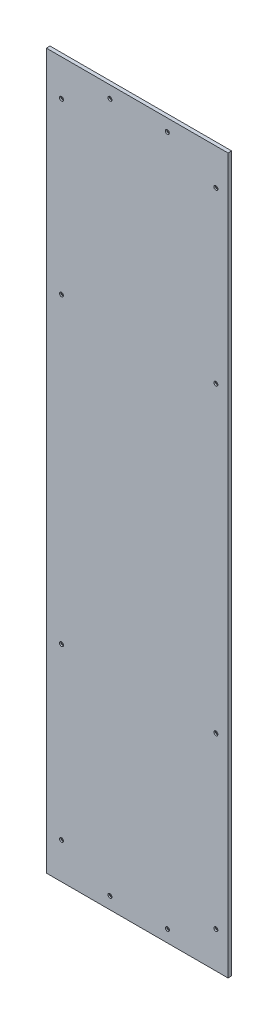
ISO-10303-21;
HEADER;
FILE_DESCRIPTION(('STEP AP214'),'2;1');
FILE_NAME('part.step','',(''),(''),'','','');
FILE_SCHEMA(('AUTOMOTIVE_DESIGN { 1 0 10303 214 1 1 1 1 }'));
ENDSEC;
DATA;
#1=APPLICATION_CONTEXT('core data for automotive mechanical design processes');
#2=APPLICATION_PROTOCOL_DEFINITION('international standard','automotive_design',2000,#1);
#3=PRODUCT_CONTEXT('',#1,'mechanical');
#4=PRODUCT('Part','Part','',(#3));
#5=PRODUCT_RELATED_PRODUCT_CATEGORY('part','',(#4));
#6=PRODUCT_DEFINITION_FORMATION('','',#4);
#7=PRODUCT_DEFINITION_CONTEXT('part definition',#1,'design');
#8=PRODUCT_DEFINITION('design','',#6,#7);
#9=PRODUCT_DEFINITION_SHAPE('','',#8);
#10=(LENGTH_UNIT() NAMED_UNIT(*) SI_UNIT(.MILLI.,.METRE.));
#11=(NAMED_UNIT(*) PLANE_ANGLE_UNIT() SI_UNIT($,.RADIAN.));
#12=(NAMED_UNIT(*) SI_UNIT($,.STERADIAN.) SOLID_ANGLE_UNIT());
#13=UNCERTAINTY_MEASURE_WITH_UNIT(LENGTH_MEASURE(1.E-05),#10,'distance_accuracy_value','');
#14=(GEOMETRIC_REPRESENTATION_CONTEXT(3) GLOBAL_UNCERTAINTY_ASSIGNED_CONTEXT((#13)) GLOBAL_UNIT_ASSIGNED_CONTEXT((#10,
#11,#12)) REPRESENTATION_CONTEXT('',''));
#15=CARTESIAN_POINT('',(0.,0.,0.));
#16=DIRECTION('',(0.,0.,1.));
#17=DIRECTION('',(1.,0.,0.));
#18=AXIS2_PLACEMENT_3D('',#15,#16,#17);
#19=CARTESIAN_POINT('',(0.,0.,-3.));
#20=DIRECTION('',(0.,0.,1.));
#21=DIRECTION('',(1.,0.,0.));
#22=AXIS2_PLACEMENT_3D('',#19,#20,#21);
#23=PLANE('',#22);
#24=CARTESIAN_POINT('',(280.,1120.,-2.9999999999859));
#25=DIRECTION('',(0.,0.,-1.));
#26=DIRECTION('',(0.,1.,0.));
#27=AXIS2_PLACEMENT_3D('',#24,#25,#26);
#28=CIRCLE('',#27,6.85500000005734);
#29=CARTESIAN_POINT('',(280.,1126.85500000006,-2.9999999999859));
#30=VERTEX_POINT('',#29);
#31=EDGE_CURVE('E69',#30,#30,#28,.F.);
#32=ORIENTED_EDGE('',*,*,#31,.T.);
#33=EDGE_LOOP('',(#32));
#34=FACE_BOUND('',#33,.T.);
#35=CARTESIAN_POINT('',(280.,60.,-2.9999999999859));
#36=DIRECTION('',(0.,0.,-1.));
#37=DIRECTION('',(0.,1.,0.));
#38=AXIS2_PLACEMENT_3D('',#35,#36,#37);
#39=CIRCLE('',#38,6.85500000005734);
#40=CARTESIAN_POINT('',(280.,66.8550000000573,-2.9999999999859));
#41=VERTEX_POINT('',#40);
#42=EDGE_CURVE('E117',#41,#41,#39,.F.);
#43=ORIENTED_EDGE('',*,*,#42,.T.);
#44=EDGE_LOOP('',(#43));
#45=FACE_BOUND('',#44,.T.);
#46=CARTESIAN_POINT('',(280.,840.,-2.9999999999859));
#47=DIRECTION('',(0.,0.,-1.));
#48=DIRECTION('',(0.,1.,0.));
#49=AXIS2_PLACEMENT_3D('',#46,#47,#48);
#50=CIRCLE('',#49,6.85500000005734);
#51=CARTESIAN_POINT('',(280.,846.855000000057,-2.9999999999859));
#52=VERTEX_POINT('',#51);
#53=EDGE_CURVE('E120',#52,#52,#50,.F.);
#54=ORIENTED_EDGE('',*,*,#53,.T.);
#55=EDGE_LOOP('',(#54));
#56=FACE_BOUND('',#55,.T.);
#57=CARTESIAN_POINT('',(280.,340.,-2.9999999999859));
#58=DIRECTION('',(0.,0.,-1.));
#59=DIRECTION('',(0.,1.,0.));
#60=AXIS2_PLACEMENT_3D('',#57,#58,#59);
#61=CIRCLE('',#60,6.85500000005734);
#62=CARTESIAN_POINT('',(280.,346.855000000057,-2.9999999999859));
#63=VERTEX_POINT('',#62);
#64=EDGE_CURVE('E123',#63,#63,#61,.F.);
#65=ORIENTED_EDGE('',*,*,#64,.T.);
#66=EDGE_LOOP('',(#65));
#67=FACE_BOUND('',#66,.T.);
#68=CARTESIAN_POINT('',(105.,1160.,-2.9999999999859));
#69=DIRECTION('',(0.,0.,-1.));
#70=DIRECTION('',(-1.,0.,0.));
#71=AXIS2_PLACEMENT_3D('',#68,#69,#70);
#72=CIRCLE('',#71,6.85499999995499);
#73=CARTESIAN_POINT('',(98.145000000045,1160.,-2.9999999999859));
#74=VERTEX_POINT('',#73);
#75=EDGE_CURVE('E126',#74,#74,#72,.F.);
#76=ORIENTED_EDGE('',*,*,#75,.T.);
#77=EDGE_LOOP('',(#76));
#78=FACE_BOUND('',#77,.T.);
#79=CARTESIAN_POINT('',(199.7,1160.,-2.99999999992906));
#80=DIRECTION('',(0.,0.,-1.));
#81=DIRECTION('',(0.,1.,0.));
#82=AXIS2_PLACEMENT_3D('',#79,#80,#81);
#83=CIRCLE('',#82,6.85499999996608);
#84=CARTESIAN_POINT('',(199.7,1166.85499999997,-2.99999999992906));
#85=VERTEX_POINT('',#84);
#86=EDGE_CURVE('E129',#85,#85,#83,.F.);
#87=ORIENTED_EDGE('',*,*,#86,.T.);
#88=EDGE_LOOP('',(#87));
#89=FACE_BOUND('',#88,.T.);
#90=CARTESIAN_POINT('',(25.,1120.,-2.9999999999859));
#91=DIRECTION('',(0.,0.,-1.));
#92=DIRECTION('',(-1.,0.,0.));
#93=AXIS2_PLACEMENT_3D('',#90,#91,#92);
#94=CIRCLE('',#93,6.85499999993908);
#95=CARTESIAN_POINT('',(18.1450000000609,1120.,-2.9999999999859));
#96=VERTEX_POINT('',#95);
#97=EDGE_CURVE('E132',#96,#96,#94,.F.);
#98=ORIENTED_EDGE('',*,*,#97,.T.);
#99=EDGE_LOOP('',(#98));
#100=FACE_BOUND('',#99,.T.);
#101=CARTESIAN_POINT('',(25.,60.,-2.9999999999859));
#102=DIRECTION('',(0.,0.,-1.));
#103=DIRECTION('',(-1.,0.,0.));
#104=AXIS2_PLACEMENT_3D('',#101,#102,#103);
#105=CIRCLE('',#104,6.85499999993908);
#106=CARTESIAN_POINT('',(18.1450000000609,60.,-2.9999999999859));
#107=VERTEX_POINT('',#106);
#108=EDGE_CURVE('E135',#107,#107,#105,.F.);
#109=ORIENTED_EDGE('',*,*,#108,.T.);
#110=EDGE_LOOP('',(#109));
#111=FACE_BOUND('',#110,.T.);
#112=CARTESIAN_POINT('',(25.,840.,-2.9999999999859));
#113=DIRECTION('',(0.,0.,-1.));
#114=DIRECTION('',(-1.,0.,0.));
#115=AXIS2_PLACEMENT_3D('',#112,#113,#114);
#116=CIRCLE('',#115,6.85499999993908);
#117=CARTESIAN_POINT('',(18.1450000000609,840.,-2.9999999999859));
#118=VERTEX_POINT('',#117);
#119=EDGE_CURVE('E138',#118,#118,#116,.F.);
#120=ORIENTED_EDGE('',*,*,#119,.T.);
#121=EDGE_LOOP('',(#120));
#122=FACE_BOUND('',#121,.T.);
#123=CARTESIAN_POINT('',(25.,340.,-2.9999999999859));
#124=DIRECTION('',(0.,0.,-1.));
#125=DIRECTION('',(-1.,0.,0.));
#126=AXIS2_PLACEMENT_3D('',#123,#124,#125);
#127=CIRCLE('',#126,6.85499999993908);
#128=CARTESIAN_POINT('',(18.1450000000609,340.,-2.9999999999859));
#129=VERTEX_POINT('',#128);
#130=EDGE_CURVE('E141',#129,#129,#127,.F.);
#131=ORIENTED_EDGE('',*,*,#130,.T.);
#132=EDGE_LOOP('',(#131));
#133=FACE_BOUND('',#132,.T.);
#134=CARTESIAN_POINT('',(105.,20.,-2.9999999999859));
#135=DIRECTION('',(0.,0.,-1.));
#136=DIRECTION('',(-1.,0.,0.));
#137=AXIS2_PLACEMENT_3D('',#134,#135,#136);
#138=CIRCLE('',#137,6.85499999995499);
#139=CARTESIAN_POINT('',(98.145000000045,20.,-2.9999999999859));
#140=VERTEX_POINT('',#139);
#141=EDGE_CURVE('E143',#140,#140,#138,.F.);
#142=ORIENTED_EDGE('',*,*,#141,.T.);
#143=EDGE_LOOP('',(#142));
#144=FACE_BOUND('',#143,.T.);
#145=CARTESIAN_POINT('',(200.,20.,-3.00000000004275));
#146=DIRECTION('',(0.,0.,-1.));
#147=DIRECTION('',(0.,1.,0.));
#148=AXIS2_PLACEMENT_3D('',#145,#146,#147);
#149=CIRCLE('',#148,6.85500000004141);
#150=CARTESIAN_POINT('',(200.,26.8550000000414,-3.00000000004275));
#151=VERTEX_POINT('',#150);
#152=EDGE_CURVE('E20',#151,#151,#149,.F.);
#153=ORIENTED_EDGE('',*,*,#152,.T.);
#154=EDGE_LOOP('',(#153));
#155=FACE_BOUND('',#154,.T.);
#156=DIRECTION('',(1.,0.,0.));
#157=VECTOR('',#156,1.);
#158=CARTESIAN_POINT('',(300.,1180.,-3.));
#159=LINE('',#158,#157);
#160=CARTESIAN_POINT('',(300.,1180.,-3.));
#161=VERTEX_POINT('',#160);
#162=CARTESIAN_POINT('',(0.,1180.,-3.));
#163=VERTEX_POINT('',#162);
#164=EDGE_CURVE('E160',#161,#163,#159,.F.);
#165=ORIENTED_EDGE('',*,*,#164,.F.);
#166=DIRECTION('',(0.,1.,0.));
#167=VECTOR('',#166,1.);
#168=CARTESIAN_POINT('',(300.,0.,-3.));
#169=LINE('',#168,#167);
#170=CARTESIAN_POINT('',(300.,0.,-3.));
#171=VERTEX_POINT('',#170);
#172=EDGE_CURVE('E71',#171,#161,#169,.T.);
#173=ORIENTED_EDGE('',*,*,#172,.F.);
#174=DIRECTION('',(1.,0.,0.));
#175=VECTOR('',#174,1.);
#176=CARTESIAN_POINT('',(0.,0.,-3.));
#177=LINE('',#176,#175);
#178=CARTESIAN_POINT('',(0.,0.,-3.));
#179=VERTEX_POINT('',#178);
#180=EDGE_CURVE('E55',#179,#171,#177,.T.);
#181=ORIENTED_EDGE('',*,*,#180,.F.);
#182=DIRECTION('',(0.,1.,0.));
#183=VECTOR('',#182,1.);
#184=CARTESIAN_POINT('',(0.,1180.,-3.));
#185=LINE('',#184,#183);
#186=EDGE_CURVE('E60',#163,#179,#185,.F.);
#187=ORIENTED_EDGE('',*,*,#186,.F.);
#188=EDGE_LOOP('',(#165,#173,#181,#187));
#189=FACE_BOUND('',#188,.T.);
#190=ADVANCED_FACE('F17',(#34,#45,#56,#67,#78,#89,#100,#111,#122,#133,#144,#155,#189),#23,.F.);
#191=CARTESIAN_POINT('',(200.,20.,-3.00000000004275));
#192=DIRECTION('',(0.,0.,-1.));
#193=DIRECTION('',(0.,1.,0.));
#194=AXIS2_PLACEMENT_3D('',#191,#192,#193);
#195=CONICAL_SURFACE('',#194,6.85500000004141,0.785397999990634);
#196=ORIENTED_EDGE('',*,*,#152,.F.);
#197=EDGE_LOOP('',(#196));
#198=FACE_BOUND('',#197,.T.);
#199=CARTESIAN_POINT('',(200.,20.,0.555001161756055));
#200=DIRECTION('',(0.,0.,-1.));
#201=DIRECTION('',(-1.,0.,0.));
#202=AXIS2_PLACEMENT_3D('',#199,#200,#201);
#203=CIRCLE('',#202,3.3);
#204=CARTESIAN_POINT('',(196.7,20.,0.555001161756055));
#205=VERTEX_POINT('',#204);
#206=EDGE_CURVE('E157',#205,#205,#203,.F.);
#207=ORIENTED_EDGE('',*,*,#206,.T.);
#208=EDGE_LOOP('',(#207));
#209=FACE_BOUND('',#208,.T.);
#210=ADVANCED_FACE('F151',(#198,#209),#195,.F.);
#211=CARTESIAN_POINT('',(105.,20.,-2.99999999992906));
#212=DIRECTION('',(0.,0.,-1.));
#213=DIRECTION('',(-1.,0.,0.));
#214=AXIS2_PLACEMENT_3D('',#211,#212,#213);
#215=CONICAL_SURFACE('',#214,6.85499999989815,0.785397999990634);
#216=ORIENTED_EDGE('',*,*,#141,.F.);
#217=EDGE_LOOP('',(#216));
#218=FACE_BOUND('',#217,.T.);
#219=CARTESIAN_POINT('',(105.,20.,0.555001161756055));
#220=DIRECTION('',(0.,0.,-1.));
#221=DIRECTION('',(-1.,0.,0.));
#222=AXIS2_PLACEMENT_3D('',#219,#220,#221);
#223=CIRCLE('',#222,3.29999999999998);
#224=CARTESIAN_POINT('',(101.7,20.,0.555001161756055));
#225=VERTEX_POINT('',#224);
#226=EDGE_CURVE('E159',#225,#225,#223,.F.);
#227=ORIENTED_EDGE('',*,*,#226,.T.);
#228=EDGE_LOOP('',(#227));
#229=FACE_BOUND('',#228,.T.);
#230=ADVANCED_FACE('F154',(#218,#229),#215,.F.);
#231=CARTESIAN_POINT('',(25.,340.,-2.99999999992906));
#232=DIRECTION('',(0.,0.,-1.));
#233=DIRECTION('',(-1.,0.,0.));
#234=AXIS2_PLACEMENT_3D('',#231,#232,#233);
#235=CONICAL_SURFACE('',#234,6.85499999988224,0.785397999990634);
#236=ORIENTED_EDGE('',*,*,#130,.F.);
#237=EDGE_LOOP('',(#236));
#238=FACE_BOUND('',#237,.T.);
#239=CARTESIAN_POINT('',(25.,340.,0.555001161756055));
#240=DIRECTION('',(0.,0.,-1.));
#241=DIRECTION('',(-1.,0.,0.));
#242=AXIS2_PLACEMENT_3D('',#239,#240,#241);
#243=CIRCLE('',#242,3.29999999999999);
#244=CARTESIAN_POINT('',(21.7,340.,0.555001161756055));
#245=VERTEX_POINT('',#244);
#246=EDGE_CURVE('E163',#245,#245,#243,.F.);
#247=ORIENTED_EDGE('',*,*,#246,.T.);
#248=EDGE_LOOP('',(#247));
#249=FACE_BOUND('',#248,.T.);
#250=ADVANCED_FACE('F235',(#238,#249),#235,.F.);
#251=CARTESIAN_POINT('',(25.,840.,-2.99999999992906));
#252=DIRECTION('',(0.,0.,-1.));
#253=DIRECTION('',(-1.,0.,0.));
#254=AXIS2_PLACEMENT_3D('',#251,#252,#253);
#255=CONICAL_SURFACE('',#254,6.85499999988224,0.785397999990634);
#256=ORIENTED_EDGE('',*,*,#119,.F.);
#257=EDGE_LOOP('',(#256));
#258=FACE_BOUND('',#257,.T.);
#259=CARTESIAN_POINT('',(25.,840.,0.555001161756055));
#260=DIRECTION('',(0.,0.,-1.));
#261=DIRECTION('',(-1.,0.,0.));
#262=AXIS2_PLACEMENT_3D('',#259,#260,#261);
#263=CIRCLE('',#262,3.29999999999999);
#264=CARTESIAN_POINT('',(21.7,840.,0.555001161756055));
#265=VERTEX_POINT('',#264);
#266=EDGE_CURVE('E223',#265,#265,#263,.F.);
#267=ORIENTED_EDGE('',*,*,#266,.T.);
#268=EDGE_LOOP('',(#267));
#269=FACE_BOUND('',#268,.T.);
#270=ADVANCED_FACE('F305',(#258,#269),#255,.F.);
#271=CARTESIAN_POINT('',(25.,60.,-2.99999999992906));
#272=DIRECTION('',(0.,0.,-1.));
#273=DIRECTION('',(-1.,0.,0.));
#274=AXIS2_PLACEMENT_3D('',#271,#272,#273);
#275=CONICAL_SURFACE('',#274,6.85499999988224,0.785397999990634);
#276=ORIENTED_EDGE('',*,*,#108,.F.);
#277=EDGE_LOOP('',(#276));
#278=FACE_BOUND('',#277,.T.);
#279=CARTESIAN_POINT('',(25.,60.,0.555001161756055));
#280=DIRECTION('',(0.,0.,-1.));
#281=DIRECTION('',(-1.,0.,0.));
#282=AXIS2_PLACEMENT_3D('',#279,#280,#281);
#283=CIRCLE('',#282,3.29999999999999);
#284=CARTESIAN_POINT('',(21.7,60.,0.555001161756055));
#285=VERTEX_POINT('',#284);
#286=EDGE_CURVE('E218',#285,#285,#283,.F.);
#287=ORIENTED_EDGE('',*,*,#286,.T.);
#288=EDGE_LOOP('',(#287));
#289=FACE_BOUND('',#288,.T.);
#290=ADVANCED_FACE('F301',(#278,#289),#275,.F.);
#291=CARTESIAN_POINT('',(25.,1120.,-2.99999999992906));
#292=DIRECTION('',(0.,0.,-1.));
#293=DIRECTION('',(-1.,0.,0.));
#294=AXIS2_PLACEMENT_3D('',#291,#292,#293);
#295=CONICAL_SURFACE('',#294,6.85499999988224,0.785397999990634);
#296=ORIENTED_EDGE('',*,*,#97,.F.);
#297=EDGE_LOOP('',(#296));
#298=FACE_BOUND('',#297,.T.);
#299=CARTESIAN_POINT('',(25.,1120.,0.555001161756055));
#300=DIRECTION('',(0.,0.,-1.));
#301=DIRECTION('',(-1.,0.,0.));
#302=AXIS2_PLACEMENT_3D('',#299,#300,#301);
#303=CIRCLE('',#302,3.29999999999999);
#304=CARTESIAN_POINT('',(21.7,1120.,0.555001161756055));
#305=VERTEX_POINT('',#304);
#306=EDGE_CURVE('E213',#305,#305,#303,.F.);
#307=ORIENTED_EDGE('',*,*,#306,.T.);
#308=EDGE_LOOP('',(#307));
#309=FACE_BOUND('',#308,.T.);
#310=ADVANCED_FACE('F297',(#298,#309),#295,.F.);
#311=CARTESIAN_POINT('',(199.7,1160.,-2.99999999987222));
#312=DIRECTION('',(0.,0.,-1.));
#313=DIRECTION('',(0.,1.,0.));
#314=AXIS2_PLACEMENT_3D('',#311,#312,#313);
#315=CONICAL_SURFACE('',#314,6.85499999990924,0.785397999990634);
#316=ORIENTED_EDGE('',*,*,#86,.F.);
#317=EDGE_LOOP('',(#316));
#318=FACE_BOUND('',#317,.T.);
#319=CARTESIAN_POINT('',(199.7,1160.,0.555001161756055));
#320=DIRECTION('',(0.,0.,-1.));
#321=DIRECTION('',(-1.,0.,0.));
#322=AXIS2_PLACEMENT_3D('',#319,#320,#321);
#323=CIRCLE('',#322,3.3);
#324=CARTESIAN_POINT('',(196.4,1160.,0.555001161756055));
#325=VERTEX_POINT('',#324);
#326=EDGE_CURVE('E208',#325,#325,#323,.F.);
#327=ORIENTED_EDGE('',*,*,#326,.T.);
#328=EDGE_LOOP('',(#327));
#329=FACE_BOUND('',#328,.T.);
#330=ADVANCED_FACE('F293',(#318,#329),#315,.F.);
#331=CARTESIAN_POINT('',(105.,1160.,-2.99999999992906));
#332=DIRECTION('',(0.,0.,-1.));
#333=DIRECTION('',(-1.,0.,0.));
#334=AXIS2_PLACEMENT_3D('',#331,#332,#333);
#335=CONICAL_SURFACE('',#334,6.85499999989815,0.785397999990634);
#336=ORIENTED_EDGE('',*,*,#75,.F.);
#337=EDGE_LOOP('',(#336));
#338=FACE_BOUND('',#337,.T.);
#339=CARTESIAN_POINT('',(105.,1160.,0.555001161756055));
#340=DIRECTION('',(0.,0.,-1.));
#341=DIRECTION('',(-1.,0.,0.));
#342=AXIS2_PLACEMENT_3D('',#339,#340,#341);
#343=CIRCLE('',#342,3.29999999999998);
#344=CARTESIAN_POINT('',(101.7,1160.,0.555001161756055));
#345=VERTEX_POINT('',#344);
#346=EDGE_CURVE('E203',#345,#345,#343,.F.);
#347=ORIENTED_EDGE('',*,*,#346,.T.);
#348=EDGE_LOOP('',(#347));
#349=FACE_BOUND('',#348,.T.);
#350=ADVANCED_FACE('F289',(#338,#349),#335,.F.);
#351=CARTESIAN_POINT('',(280.,340.,-2.99999999987222));
#352=DIRECTION('',(0.,0.,-1.));
#353=DIRECTION('',(0.,1.,0.));
#354=AXIS2_PLACEMENT_3D('',#351,#352,#353);
#355=CONICAL_SURFACE('',#354,6.85499999994366,0.785398000006624);
#356=ORIENTED_EDGE('',*,*,#64,.F.);
#357=EDGE_LOOP('',(#356));
#358=FACE_BOUND('',#357,.T.);
#359=CARTESIAN_POINT('',(280.,340.,0.555001161756055));
#360=DIRECTION('',(0.,0.,-1.));
#361=DIRECTION('',(-1.,0.,0.));
#362=AXIS2_PLACEMENT_3D('',#359,#360,#361);
#363=CIRCLE('',#362,3.29999999999997);
#364=CARTESIAN_POINT('',(276.7,340.,0.555001161756055));
#365=VERTEX_POINT('',#364);
#366=EDGE_CURVE('E198',#365,#365,#363,.F.);
#367=ORIENTED_EDGE('',*,*,#366,.T.);
#368=EDGE_LOOP('',(#367));
#369=FACE_BOUND('',#368,.T.);
#370=ADVANCED_FACE('F285',(#358,#369),#355,.F.);
#371=CARTESIAN_POINT('',(280.,840.,-2.99999999987222));
#372=DIRECTION('',(0.,0.,-1.));
#373=DIRECTION('',(0.,1.,0.));
#374=AXIS2_PLACEMENT_3D('',#371,#372,#373);
#375=CONICAL_SURFACE('',#374,6.85499999994366,0.785398000006624);
#376=ORIENTED_EDGE('',*,*,#53,.F.);
#377=EDGE_LOOP('',(#376));
#378=FACE_BOUND('',#377,.T.);
#379=CARTESIAN_POINT('',(280.,840.,0.555001161756055));
#380=DIRECTION('',(0.,0.,-1.));
#381=DIRECTION('',(-1.,0.,0.));
#382=AXIS2_PLACEMENT_3D('',#379,#380,#381);
#383=CIRCLE('',#382,3.29999999999997);
#384=CARTESIAN_POINT('',(276.7,840.,0.555001161756055));
#385=VERTEX_POINT('',#384);
#386=EDGE_CURVE('E193',#385,#385,#383,.F.);
#387=ORIENTED_EDGE('',*,*,#386,.T.);
#388=EDGE_LOOP('',(#387));
#389=FACE_BOUND('',#388,.T.);
#390=ADVANCED_FACE('F281',(#378,#389),#375,.F.);
#391=CARTESIAN_POINT('',(280.,60.,-2.99999999987222));
#392=DIRECTION('',(0.,0.,-1.));
#393=DIRECTION('',(0.,1.,0.));
#394=AXIS2_PLACEMENT_3D('',#391,#392,#393);
#395=CONICAL_SURFACE('',#394,6.85499999994366,0.785398000006624);
#396=ORIENTED_EDGE('',*,*,#42,.F.);
#397=EDGE_LOOP('',(#396));
#398=FACE_BOUND('',#397,.T.);
#399=CARTESIAN_POINT('',(280.,60.,0.555001161756055));
#400=DIRECTION('',(0.,0.,-1.));
#401=DIRECTION('',(-1.,0.,0.));
#402=AXIS2_PLACEMENT_3D('',#399,#400,#401);
#403=CIRCLE('',#402,3.29999999999997);
#404=CARTESIAN_POINT('',(276.7,60.,0.555001161756055));
#405=VERTEX_POINT('',#404);
#406=EDGE_CURVE('E188',#405,#405,#403,.F.);
#407=ORIENTED_EDGE('',*,*,#406,.T.);
#408=EDGE_LOOP('',(#407));
#409=FACE_BOUND('',#408,.T.);
#410=ADVANCED_FACE('F277',(#398,#409),#395,.F.);
#411=CARTESIAN_POINT('',(280.,1120.,-2.99999999987222));
#412=DIRECTION('',(0.,0.,-1.));
#413=DIRECTION('',(0.,1.,0.));
#414=AXIS2_PLACEMENT_3D('',#411,#412,#413);
#415=CONICAL_SURFACE('',#414,6.85499999994366,0.785398000006624);
#416=ORIENTED_EDGE('',*,*,#31,.F.);
#417=EDGE_LOOP('',(#416));
#418=FACE_BOUND('',#417,.T.);
#419=CARTESIAN_POINT('',(280.,1120.,0.555001161756055));
#420=DIRECTION('',(0.,0.,-1.));
#421=DIRECTION('',(-1.,0.,0.));
#422=AXIS2_PLACEMENT_3D('',#419,#420,#421);
#423=CIRCLE('',#422,3.29999999999997);
#424=CARTESIAN_POINT('',(276.7,1120.,0.555001161756055));
#425=VERTEX_POINT('',#424);
#426=EDGE_CURVE('E182',#425,#425,#423,.F.);
#427=ORIENTED_EDGE('',*,*,#426,.T.);
#428=EDGE_LOOP('',(#427));
#429=FACE_BOUND('',#428,.T.);
#430=ADVANCED_FACE('F274',(#418,#429),#415,.F.);
#431=CARTESIAN_POINT('',(0.,1180.,-3.));
#432=DIRECTION('',(-1.,0.,0.));
#433=DIRECTION('',(0.,0.,1.));
#434=AXIS2_PLACEMENT_3D('',#431,#432,#433);
#435=PLANE('',#434);
#436=DIRECTION('',(0.,0.,1.));
#437=VECTOR('',#436,1.);
#438=CARTESIAN_POINT('',(0.,1180.,-3.));
#439=LINE('',#438,#437);
#440=CARTESIAN_POINT('',(0.,1180.,3.));
#441=VERTEX_POINT('',#440);
#442=EDGE_CURVE('E65',#163,#441,#439,.T.);
#443=ORIENTED_EDGE('',*,*,#442,.F.);
#444=ORIENTED_EDGE('',*,*,#186,.T.);
#445=DIRECTION('',(0.,0.,-1.));
#446=VECTOR('',#445,1.);
#447=CARTESIAN_POINT('',(0.,0.,-3.));
#448=LINE('',#447,#446);
#449=CARTESIAN_POINT('',(0.,0.,3.));
#450=VERTEX_POINT('',#449);
#451=EDGE_CURVE('E62',#450,#179,#448,.T.);
#452=ORIENTED_EDGE('',*,*,#451,.F.);
#453=DIRECTION('',(0.,1.,0.));
#454=VECTOR('',#453,1.);
#455=CARTESIAN_POINT('',(0.,0.,3.));
#456=LINE('',#455,#454);
#457=EDGE_CURVE('E180',#441,#450,#456,.F.);
#458=ORIENTED_EDGE('',*,*,#457,.F.);
#459=EDGE_LOOP('',(#443,#444,#452,#458));
#460=FACE_BOUND('',#459,.T.);
#461=ADVANCED_FACE('F61',(#460),#435,.T.);
#462=CARTESIAN_POINT('',(0.,0.,-3.));
#463=DIRECTION('',(0.,-1.,0.));
#464=DIRECTION('',(0.,0.,-1.));
#465=AXIS2_PLACEMENT_3D('',#462,#463,#464);
#466=PLANE('',#465);
#467=ORIENTED_EDGE('',*,*,#451,.T.);
#468=ORIENTED_EDGE('',*,*,#180,.T.);
#469=DIRECTION('',(0.,0.,-1.));
#470=VECTOR('',#469,1.);
#471=CARTESIAN_POINT('',(300.,0.,-3.));
#472=LINE('',#471,#470);
#473=CARTESIAN_POINT('',(300.,0.,3.));
#474=VERTEX_POINT('',#473);
#475=EDGE_CURVE('E73',#474,#171,#472,.T.);
#476=ORIENTED_EDGE('',*,*,#475,.F.);
#477=DIRECTION('',(1.,0.,0.));
#478=VECTOR('',#477,1.);
#479=CARTESIAN_POINT('',(0.,0.,3.));
#480=LINE('',#479,#478);
#481=EDGE_CURVE('E77',#450,#474,#480,.T.);
#482=ORIENTED_EDGE('',*,*,#481,.F.);
#483=EDGE_LOOP('',(#467,#468,#476,#482));
#484=FACE_BOUND('',#483,.T.);
#485=ADVANCED_FACE('F75',(#484),#466,.T.);
#486=CARTESIAN_POINT('',(300.,0.,-3.));
#487=DIRECTION('',(1.,0.,0.));
#488=DIRECTION('',(0.,0.,-1.));
#489=AXIS2_PLACEMENT_3D('',#486,#487,#488);
#490=PLANE('',#489);
#491=ORIENTED_EDGE('',*,*,#475,.T.);
#492=ORIENTED_EDGE('',*,*,#172,.T.);
#493=DIRECTION('',(0.,0.,1.));
#494=VECTOR('',#493,1.);
#495=CARTESIAN_POINT('',(300.,1180.,-3.));
#496=LINE('',#495,#494);
#497=CARTESIAN_POINT('',(300.,1180.,3.));
#498=VERTEX_POINT('',#497);
#499=EDGE_CURVE('E35',#498,#161,#496,.F.);
#500=ORIENTED_EDGE('',*,*,#499,.F.);
#501=DIRECTION('',(0.,1.,0.));
#502=VECTOR('',#501,1.);
#503=CARTESIAN_POINT('',(300.,0.,3.));
#504=LINE('',#503,#502);
#505=EDGE_CURVE('E175',#474,#498,#504,.T.);
#506=ORIENTED_EDGE('',*,*,#505,.F.);
#507=EDGE_LOOP('',(#491,#492,#500,#506));
#508=FACE_BOUND('',#507,.T.);
#509=ADVANCED_FACE('F173',(#508),#490,.T.);
#510=CARTESIAN_POINT('',(300.,1180.,-3.));
#511=DIRECTION('',(0.,1.,0.));
#512=DIRECTION('',(0.,0.,1.));
#513=AXIS2_PLACEMENT_3D('',#510,#511,#512);
#514=PLANE('',#513);
#515=ORIENTED_EDGE('',*,*,#499,.T.);
#516=ORIENTED_EDGE('',*,*,#164,.T.);
#517=ORIENTED_EDGE('',*,*,#442,.T.);
#518=DIRECTION('',(1.,0.,0.));
#519=VECTOR('',#518,1.);
#520=CARTESIAN_POINT('',(0.,1180.,3.));
#521=LINE('',#520,#519);
#522=EDGE_CURVE('E114',#498,#441,#521,.F.);
#523=ORIENTED_EDGE('',*,*,#522,.F.);
#524=EDGE_LOOP('',(#515,#516,#517,#523));
#525=FACE_BOUND('',#524,.T.);
#526=ADVANCED_FACE('F256',(#525),#514,.T.);
#527=CARTESIAN_POINT('',(200.,20.,-3.));
#528=DIRECTION('',(0.,0.,-1.));
#529=DIRECTION('',(-1.,0.,0.));
#530=AXIS2_PLACEMENT_3D('',#527,#528,#529);
#531=CYLINDRICAL_SURFACE('',#530,3.3);
#532=ORIENTED_EDGE('',*,*,#206,.F.);
#533=EDGE_LOOP('',(#532));
#534=FACE_BOUND('',#533,.T.);
#535=CARTESIAN_POINT('',(200.,20.,3.00000000000001));
#536=DIRECTION('',(0.,0.,-1.));
#537=DIRECTION('',(-1.,0.,0.));
#538=AXIS2_PLACEMENT_3D('',#535,#536,#537);
#539=CIRCLE('',#538,3.3);
#540=CARTESIAN_POINT('',(196.7,20.,3.00000000000001));
#541=VERTEX_POINT('',#540);
#542=EDGE_CURVE('E111',#541,#541,#539,.T.);
#543=ORIENTED_EDGE('',*,*,#542,.F.);
#544=EDGE_LOOP('',(#543));
#545=FACE_BOUND('',#544,.T.);
#546=ADVANCED_FACE('F254',(#534,#545),#531,.F.);
#547=CARTESIAN_POINT('',(105.,20.,-3.));
#548=DIRECTION('',(0.,0.,-1.));
#549=DIRECTION('',(-1.,0.,0.));
#550=AXIS2_PLACEMENT_3D('',#547,#548,#549);
#551=CYLINDRICAL_SURFACE('',#550,3.29999999999998);
#552=ORIENTED_EDGE('',*,*,#226,.F.);
#553=EDGE_LOOP('',(#552));
#554=FACE_BOUND('',#553,.T.);
#555=CARTESIAN_POINT('',(105.,20.,3.00000000000001));
#556=DIRECTION('',(0.,0.,-1.));
#557=DIRECTION('',(-1.,0.,0.));
#558=AXIS2_PLACEMENT_3D('',#555,#556,#557);
#559=CIRCLE('',#558,3.29999999999998);
#560=CARTESIAN_POINT('',(101.7,20.,3.00000000000001));
#561=VERTEX_POINT('',#560);
#562=EDGE_CURVE('E108',#561,#561,#559,.T.);
#563=ORIENTED_EDGE('',*,*,#562,.F.);
#564=EDGE_LOOP('',(#563));
#565=FACE_BOUND('',#564,.T.);
#566=ADVANCED_FACE('F241',(#554,#565),#551,.F.);
#567=CARTESIAN_POINT('',(25.,340.,-3.));
#568=DIRECTION('',(0.,0.,-1.));
#569=DIRECTION('',(-1.,0.,0.));
#570=AXIS2_PLACEMENT_3D('',#567,#568,#569);
#571=CYLINDRICAL_SURFACE('',#570,3.29999999999999);
#572=ORIENTED_EDGE('',*,*,#246,.F.);
#573=EDGE_LOOP('',(#572));
#574=FACE_BOUND('',#573,.T.);
#575=CARTESIAN_POINT('',(25.,340.,3.00000000000001));
#576=DIRECTION('',(0.,0.,-1.));
#577=DIRECTION('',(-1.,0.,0.));
#578=AXIS2_PLACEMENT_3D('',#575,#576,#577);
#579=CIRCLE('',#578,3.29999999999999);
#580=CARTESIAN_POINT('',(21.7,340.,3.00000000000001));
#581=VERTEX_POINT('',#580);
#582=EDGE_CURVE('E105',#581,#581,#579,.T.);
#583=ORIENTED_EDGE('',*,*,#582,.F.);
#584=EDGE_LOOP('',(#583));
#585=FACE_BOUND('',#584,.T.);
#586=ADVANCED_FACE('F237',(#574,#585),#571,.F.);
#587=CARTESIAN_POINT('',(25.,840.,-3.));
#588=DIRECTION('',(0.,0.,-1.));
#589=DIRECTION('',(-1.,0.,0.));
#590=AXIS2_PLACEMENT_3D('',#587,#588,#589);
#591=CYLINDRICAL_SURFACE('',#590,3.29999999999999);
#592=ORIENTED_EDGE('',*,*,#266,.F.);
#593=EDGE_LOOP('',(#592));
#594=FACE_BOUND('',#593,.T.);
#595=CARTESIAN_POINT('',(25.,840.,3.00000000000001));
#596=DIRECTION('',(0.,0.,-1.));
#597=DIRECTION('',(-1.,0.,0.));
#598=AXIS2_PLACEMENT_3D('',#595,#596,#597);
#599=CIRCLE('',#598,3.29999999999999);
#600=CARTESIAN_POINT('',(21.7,840.,3.00000000000001));
#601=VERTEX_POINT('',#600);
#602=EDGE_CURVE('E102',#601,#601,#599,.T.);
#603=ORIENTED_EDGE('',*,*,#602,.F.);
#604=EDGE_LOOP('',(#603));
#605=FACE_BOUND('',#604,.T.);
#606=ADVANCED_FACE('F240',(#594,#605),#591,.F.);
#607=CARTESIAN_POINT('',(25.,60.,-3.));
#608=DIRECTION('',(0.,0.,-1.));
#609=DIRECTION('',(-1.,0.,0.));
#610=AXIS2_PLACEMENT_3D('',#607,#608,#609);
#611=CYLINDRICAL_SURFACE('',#610,3.29999999999999);
#612=ORIENTED_EDGE('',*,*,#286,.F.);
#613=EDGE_LOOP('',(#612));
#614=FACE_BOUND('',#613,.T.);
#615=CARTESIAN_POINT('',(25.,60.,3.00000000000001));
#616=DIRECTION('',(0.,0.,-1.));
#617=DIRECTION('',(-1.,0.,0.));
#618=AXIS2_PLACEMENT_3D('',#615,#616,#617);
#619=CIRCLE('',#618,3.29999999999999);
#620=CARTESIAN_POINT('',(21.7,60.,3.00000000000001));
#621=VERTEX_POINT('',#620);
#622=EDGE_CURVE('E99',#621,#621,#619,.T.);
#623=ORIENTED_EDGE('',*,*,#622,.F.);
#624=EDGE_LOOP('',(#623));
#625=FACE_BOUND('',#624,.T.);
#626=ADVANCED_FACE('F409',(#614,#625),#611,.F.);
#627=CARTESIAN_POINT('',(25.,1120.,-3.));
#628=DIRECTION('',(0.,0.,-1.));
#629=DIRECTION('',(-1.,0.,0.));
#630=AXIS2_PLACEMENT_3D('',#627,#628,#629);
#631=CYLINDRICAL_SURFACE('',#630,3.29999999999999);
#632=ORIENTED_EDGE('',*,*,#306,.F.);
#633=EDGE_LOOP('',(#632));
#634=FACE_BOUND('',#633,.T.);
#635=CARTESIAN_POINT('',(25.,1120.,3.00000000000001));
#636=DIRECTION('',(0.,0.,-1.));
#637=DIRECTION('',(-1.,0.,0.));
#638=AXIS2_PLACEMENT_3D('',#635,#636,#637);
#639=CIRCLE('',#638,3.29999999999999);
#640=CARTESIAN_POINT('',(21.7,1120.,3.00000000000001));
#641=VERTEX_POINT('',#640);
#642=EDGE_CURVE('E96',#641,#641,#639,.T.);
#643=ORIENTED_EDGE('',*,*,#642,.F.);
#644=EDGE_LOOP('',(#643));
#645=FACE_BOUND('',#644,.T.);
#646=ADVANCED_FACE('F419',(#634,#645),#631,.F.);
#647=CARTESIAN_POINT('',(199.7,1160.,-3.));
#648=DIRECTION('',(0.,0.,-1.));
#649=DIRECTION('',(-1.,0.,0.));
#650=AXIS2_PLACEMENT_3D('',#647,#648,#649);
#651=CYLINDRICAL_SURFACE('',#650,3.3);
#652=ORIENTED_EDGE('',*,*,#326,.F.);
#653=EDGE_LOOP('',(#652));
#654=FACE_BOUND('',#653,.T.);
#655=CARTESIAN_POINT('',(199.7,1160.,3.00000000000001));
#656=DIRECTION('',(0.,0.,-1.));
#657=DIRECTION('',(-1.,0.,0.));
#658=AXIS2_PLACEMENT_3D('',#655,#656,#657);
#659=CIRCLE('',#658,3.3);
#660=CARTESIAN_POINT('',(196.4,1160.,3.00000000000001));
#661=VERTEX_POINT('',#660);
#662=EDGE_CURVE('E93',#661,#661,#659,.T.);
#663=ORIENTED_EDGE('',*,*,#662,.F.);
#664=EDGE_LOOP('',(#663));
#665=FACE_BOUND('',#664,.T.);
#666=ADVANCED_FACE('F429',(#654,#665),#651,.F.);
#667=CARTESIAN_POINT('',(105.,1160.,-3.));
#668=DIRECTION('',(0.,0.,-1.));
#669=DIRECTION('',(-1.,0.,0.));
#670=AXIS2_PLACEMENT_3D('',#667,#668,#669);
#671=CYLINDRICAL_SURFACE('',#670,3.29999999999998);
#672=ORIENTED_EDGE('',*,*,#346,.F.);
#673=EDGE_LOOP('',(#672));
#674=FACE_BOUND('',#673,.T.);
#675=CARTESIAN_POINT('',(105.,1160.,3.00000000000001));
#676=DIRECTION('',(0.,0.,-1.));
#677=DIRECTION('',(-1.,0.,0.));
#678=AXIS2_PLACEMENT_3D('',#675,#676,#677);
#679=CIRCLE('',#678,3.29999999999998);
#680=CARTESIAN_POINT('',(101.7,1160.,3.00000000000001));
#681=VERTEX_POINT('',#680);
#682=EDGE_CURVE('E90',#681,#681,#679,.T.);
#683=ORIENTED_EDGE('',*,*,#682,.F.);
#684=EDGE_LOOP('',(#683));
#685=FACE_BOUND('',#684,.T.);
#686=ADVANCED_FACE('F439',(#674,#685),#671,.F.);
#687=CARTESIAN_POINT('',(280.,340.,-3.));
#688=DIRECTION('',(0.,0.,-1.));
#689=DIRECTION('',(-1.,0.,0.));
#690=AXIS2_PLACEMENT_3D('',#687,#688,#689);
#691=CYLINDRICAL_SURFACE('',#690,3.29999999999997);
#692=ORIENTED_EDGE('',*,*,#366,.F.);
#693=EDGE_LOOP('',(#692));
#694=FACE_BOUND('',#693,.T.);
#695=CARTESIAN_POINT('',(280.,340.,3.00000000000001));
#696=DIRECTION('',(0.,0.,-1.));
#697=DIRECTION('',(-1.,0.,0.));
#698=AXIS2_PLACEMENT_3D('',#695,#696,#697);
#699=CIRCLE('',#698,3.29999999999997);
#700=CARTESIAN_POINT('',(276.7,340.,3.00000000000001));
#701=VERTEX_POINT('',#700);
#702=EDGE_CURVE('E87',#701,#701,#699,.T.);
#703=ORIENTED_EDGE('',*,*,#702,.F.);
#704=EDGE_LOOP('',(#703));
#705=FACE_BOUND('',#704,.T.);
#706=ADVANCED_FACE('F449',(#694,#705),#691,.F.);
#707=CARTESIAN_POINT('',(280.,840.,-3.));
#708=DIRECTION('',(0.,0.,-1.));
#709=DIRECTION('',(-1.,0.,0.));
#710=AXIS2_PLACEMENT_3D('',#707,#708,#709);
#711=CYLINDRICAL_SURFACE('',#710,3.29999999999997);
#712=ORIENTED_EDGE('',*,*,#386,.F.);
#713=EDGE_LOOP('',(#712));
#714=FACE_BOUND('',#713,.T.);
#715=CARTESIAN_POINT('',(280.,840.,3.00000000000001));
#716=DIRECTION('',(0.,0.,-1.));
#717=DIRECTION('',(-1.,0.,0.));
#718=AXIS2_PLACEMENT_3D('',#715,#716,#717);
#719=CIRCLE('',#718,3.29999999999997);
#720=CARTESIAN_POINT('',(276.7,840.,3.00000000000001));
#721=VERTEX_POINT('',#720);
#722=EDGE_CURVE('E84',#721,#721,#719,.T.);
#723=ORIENTED_EDGE('',*,*,#722,.F.);
#724=EDGE_LOOP('',(#723));
#725=FACE_BOUND('',#724,.T.);
#726=ADVANCED_FACE('F459',(#714,#725),#711,.F.);
#727=CARTESIAN_POINT('',(280.,60.,-3.));
#728=DIRECTION('',(0.,0.,-1.));
#729=DIRECTION('',(-1.,0.,0.));
#730=AXIS2_PLACEMENT_3D('',#727,#728,#729);
#731=CYLINDRICAL_SURFACE('',#730,3.29999999999997);
#732=ORIENTED_EDGE('',*,*,#406,.F.);
#733=EDGE_LOOP('',(#732));
#734=FACE_BOUND('',#733,.T.);
#735=CARTESIAN_POINT('',(280.,60.,3.00000000000001));
#736=DIRECTION('',(0.,0.,-1.));
#737=DIRECTION('',(-1.,0.,0.));
#738=AXIS2_PLACEMENT_3D('',#735,#736,#737);
#739=CIRCLE('',#738,3.29999999999997);
#740=CARTESIAN_POINT('',(276.7,60.,3.00000000000001));
#741=VERTEX_POINT('',#740);
#742=EDGE_CURVE('E26',#741,#741,#739,.T.);
#743=ORIENTED_EDGE('',*,*,#742,.F.);
#744=EDGE_LOOP('',(#743));
#745=FACE_BOUND('',#744,.T.);
#746=ADVANCED_FACE('F469',(#734,#745),#731,.F.);
#747=CARTESIAN_POINT('',(280.,1120.,-3.));
#748=DIRECTION('',(0.,0.,-1.));
#749=DIRECTION('',(-1.,0.,0.));
#750=AXIS2_PLACEMENT_3D('',#747,#748,#749);
#751=CYLINDRICAL_SURFACE('',#750,3.29999999999997);
#752=ORIENTED_EDGE('',*,*,#426,.F.);
#753=EDGE_LOOP('',(#752));
#754=FACE_BOUND('',#753,.T.);
#755=CARTESIAN_POINT('',(280.,1120.,3.00000000000001));
#756=DIRECTION('',(0.,0.,-1.));
#757=DIRECTION('',(-1.,0.,0.));
#758=AXIS2_PLACEMENT_3D('',#755,#756,#757);
#759=CIRCLE('',#758,3.29999999999997);
#760=CARTESIAN_POINT('',(276.7,1120.,3.00000000000001));
#761=VERTEX_POINT('',#760);
#762=EDGE_CURVE('E11',#761,#761,#759,.T.);
#763=ORIENTED_EDGE('',*,*,#762,.F.);
#764=EDGE_LOOP('',(#763));
#765=FACE_BOUND('',#764,.T.);
#766=ADVANCED_FACE('F247',(#754,#765),#751,.F.);
#767=CARTESIAN_POINT('',(0.,0.,3.));
#768=DIRECTION('',(0.,0.,1.));
#769=DIRECTION('',(1.,0.,0.));
#770=AXIS2_PLACEMENT_3D('',#767,#768,#769);
#771=PLANE('',#770);
#772=ORIENTED_EDGE('',*,*,#762,.T.);
#773=EDGE_LOOP('',(#772));
#774=FACE_BOUND('',#773,.T.);
#775=ORIENTED_EDGE('',*,*,#742,.T.);
#776=EDGE_LOOP('',(#775));
#777=FACE_BOUND('',#776,.T.);
#778=ORIENTED_EDGE('',*,*,#722,.T.);
#779=EDGE_LOOP('',(#778));
#780=FACE_BOUND('',#779,.T.);
#781=ORIENTED_EDGE('',*,*,#702,.T.);
#782=EDGE_LOOP('',(#781));
#783=FACE_BOUND('',#782,.T.);
#784=ORIENTED_EDGE('',*,*,#682,.T.);
#785=EDGE_LOOP('',(#784));
#786=FACE_BOUND('',#785,.T.);
#787=ORIENTED_EDGE('',*,*,#662,.T.);
#788=EDGE_LOOP('',(#787));
#789=FACE_BOUND('',#788,.T.);
#790=ORIENTED_EDGE('',*,*,#642,.T.);
#791=EDGE_LOOP('',(#790));
#792=FACE_BOUND('',#791,.T.);
#793=ORIENTED_EDGE('',*,*,#622,.T.);
#794=EDGE_LOOP('',(#793));
#795=FACE_BOUND('',#794,.T.);
#796=ORIENTED_EDGE('',*,*,#602,.T.);
#797=EDGE_LOOP('',(#796));
#798=FACE_BOUND('',#797,.T.);
#799=ORIENTED_EDGE('',*,*,#582,.T.);
#800=EDGE_LOOP('',(#799));
#801=FACE_BOUND('',#800,.T.);
#802=ORIENTED_EDGE('',*,*,#562,.T.);
#803=EDGE_LOOP('',(#802));
#804=FACE_BOUND('',#803,.T.);
#805=ORIENTED_EDGE('',*,*,#542,.T.);
#806=EDGE_LOOP('',(#805));
#807=FACE_BOUND('',#806,.T.);
#808=ORIENTED_EDGE('',*,*,#505,.T.);
#809=ORIENTED_EDGE('',*,*,#522,.T.);
#810=ORIENTED_EDGE('',*,*,#457,.T.);
#811=ORIENTED_EDGE('',*,*,#481,.T.);
#812=EDGE_LOOP('',(#808,#809,#810,#811));
#813=FACE_BOUND('',#812,.T.);
#814=ADVANCED_FACE('F179',(#774,#777,#780,#783,#786,#789,#792,#795,#798,#801,#804,#807,#813),
#771,.T.);
#815=CLOSED_SHELL('',(#190,#210,#230,#250,#270,#290,#310,#330,#350,#370,#390,#410,#430,#461,
#485,#509,#526,#546,#566,#586,#606,#626,#646,#666,#686,#706,#726,#746,#766,#814));
#816=MANIFOLD_SOLID_BREP('B1',#815);
#817=ADVANCED_BREP_SHAPE_REPRESENTATION('',(#18,#816),#14);
#818=SHAPE_DEFINITION_REPRESENTATION(#9,#817);
ENDSEC;
END-ISO-10303-21;
